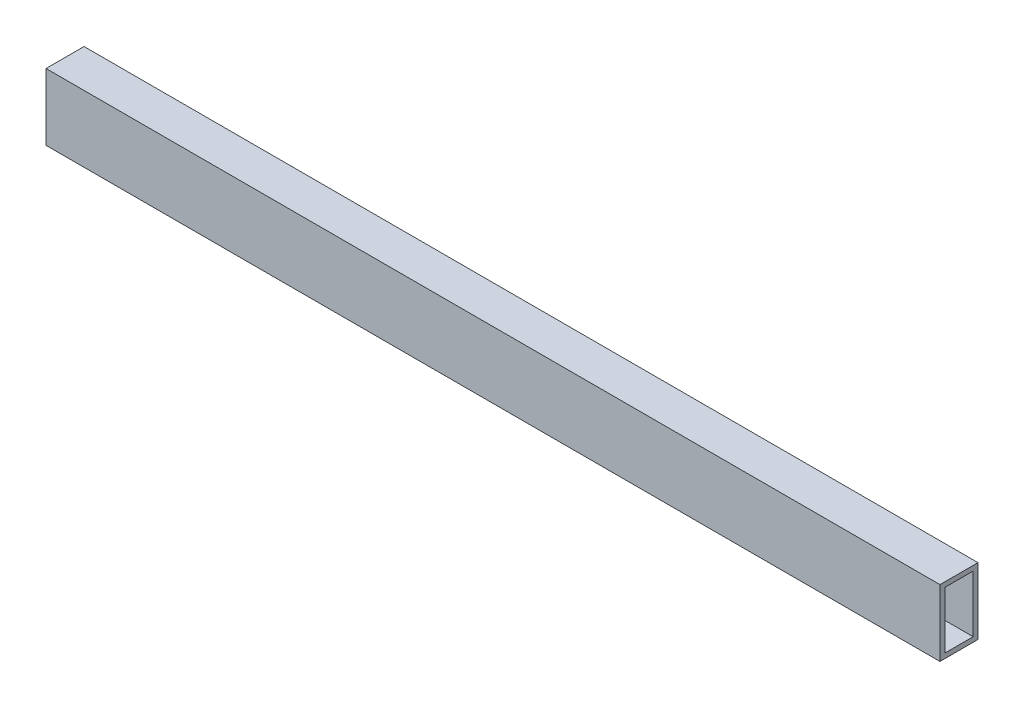
ISO-10303-21;
HEADER;
FILE_DESCRIPTION(('STEP AP214'),'2;1');
FILE_NAME('part.step','',(''),(''),'','','');
FILE_SCHEMA(('AUTOMOTIVE_DESIGN { 1 0 10303 214 1 1 1 1 }'));
ENDSEC;
DATA;
#1=APPLICATION_CONTEXT('core data for automotive mechanical design processes');
#2=APPLICATION_PROTOCOL_DEFINITION('international standard','automotive_design',2000,#1);
#3=PRODUCT_CONTEXT('',#1,'mechanical');
#4=PRODUCT('Part','Part','',(#3));
#5=PRODUCT_RELATED_PRODUCT_CATEGORY('part','',(#4));
#6=PRODUCT_DEFINITION_FORMATION('','',#4);
#7=PRODUCT_DEFINITION_CONTEXT('part definition',#1,'design');
#8=PRODUCT_DEFINITION('design','',#6,#7);
#9=PRODUCT_DEFINITION_SHAPE('','',#8);
#10=(LENGTH_UNIT() NAMED_UNIT(*) SI_UNIT(.MILLI.,.METRE.));
#11=(NAMED_UNIT(*) PLANE_ANGLE_UNIT() SI_UNIT($,.RADIAN.));
#12=(NAMED_UNIT(*) SI_UNIT($,.STERADIAN.) SOLID_ANGLE_UNIT());
#13=UNCERTAINTY_MEASURE_WITH_UNIT(LENGTH_MEASURE(1.E-05),#10,'distance_accuracy_value','');
#14=(GEOMETRIC_REPRESENTATION_CONTEXT(3) GLOBAL_UNCERTAINTY_ASSIGNED_CONTEXT((#13)) GLOBAL_UNIT_ASSIGNED_CONTEXT((#10,
#11,#12)) REPRESENTATION_CONTEXT('',''));
#15=CARTESIAN_POINT('',(0.,0.,0.));
#16=DIRECTION('',(0.,0.,1.));
#17=DIRECTION('',(1.,0.,0.));
#18=AXIS2_PLACEMENT_3D('',#15,#16,#17);
#19=CARTESIAN_POINT('',(-9470.21817788958,3159.13142400252,25.4));
#20=DIRECTION('',(1.,0.,0.));
#21=DIRECTION('',(0.,0.,-1.));
#22=AXIS2_PLACEMENT_3D('',#19,#20,#21);
#23=PLANE('',#22);
#24=DIRECTION('',(0.,0.,1.));
#25=VECTOR('',#24,1.);
#26=CARTESIAN_POINT('',(-9470.21817788958,3155.89292400252,25.4));
#27=LINE('',#26,#25);
#28=CARTESIAN_POINT('',(-9470.21817788958,3155.89292400252,3.2385));
#29=VERTEX_POINT('',#28);
#30=CARTESIAN_POINT('',(-9470.21817788958,3155.89292400252,22.1615));
#31=VERTEX_POINT('',#30);
#32=EDGE_CURVE('E144',#29,#31,#27,.T.);
#33=ORIENTED_EDGE('',*,*,#32,.T.);
#34=DIRECTION('',(0.,-1.,0.));
#35=VECTOR('',#34,1.);
#36=CARTESIAN_POINT('',(-9470.21817788958,3159.13142400252,22.1615));
#37=LINE('',#36,#35);
#38=CARTESIAN_POINT('',(-9470.21817788958,3117.91992400252,22.1615));
#39=VERTEX_POINT('',#38);
#40=EDGE_CURVE('E148',#31,#39,#37,.T.);
#41=ORIENTED_EDGE('',*,*,#40,.T.);
#42=DIRECTION('',(0.,0.,-1.));
#43=VECTOR('',#42,1.);
#44=CARTESIAN_POINT('',(-9470.21817788958,3117.91992400252,25.4));
#45=LINE('',#44,#43);
#46=CARTESIAN_POINT('',(-9470.21817788958,3117.91992400252,3.23849999999999));
#47=VERTEX_POINT('',#46);
#48=EDGE_CURVE('E135',#39,#47,#45,.T.);
#49=ORIENTED_EDGE('',*,*,#48,.T.);
#50=DIRECTION('',(0.,1.,0.));
#51=VECTOR('',#50,1.);
#52=CARTESIAN_POINT('',(-9470.21817788958,3159.13142400252,3.2385));
#53=LINE('',#52,#51);
#54=EDGE_CURVE('E110',#47,#29,#53,.T.);
#55=ORIENTED_EDGE('',*,*,#54,.T.);
#56=EDGE_LOOP('',(#33,#41,#49,#55));
#57=FACE_BOUND('',#56,.T.);
#58=DIRECTION('',(0.,-1.,0.));
#59=VECTOR('',#58,1.);
#60=CARTESIAN_POINT('',(-9470.21817788958,3159.13142400252,0.));
#61=LINE('',#60,#59);
#62=CARTESIAN_POINT('',(-9470.21817788958,3159.13142400252,0.));
#63=VERTEX_POINT('',#62);
#64=CARTESIAN_POINT('',(-9470.21817788958,3114.68142400252,0.));
#65=VERTEX_POINT('',#64);
#66=EDGE_CURVE('E152',#63,#65,#61,.T.);
#67=ORIENTED_EDGE('',*,*,#66,.T.);
#68=DIRECTION('',(0.,0.,-1.));
#69=VECTOR('',#68,1.);
#70=CARTESIAN_POINT('',(-9470.21817788958,3114.68142400252,25.4));
#71=LINE('',#70,#69);
#72=CARTESIAN_POINT('',(-9470.21817788958,3114.68142400252,25.4));
#73=VERTEX_POINT('',#72);
#74=EDGE_CURVE('E11',#73,#65,#71,.T.);
#75=ORIENTED_EDGE('',*,*,#74,.F.);
#76=DIRECTION('',(0.,-1.,0.));
#77=VECTOR('',#76,1.);
#78=CARTESIAN_POINT('',(-9470.21817788958,3159.13142400252,25.4));
#79=LINE('',#78,#77);
#80=CARTESIAN_POINT('',(-9470.21817788958,3159.13142400252,25.4));
#81=VERTEX_POINT('',#80);
#82=EDGE_CURVE('E153',#81,#73,#79,.T.);
#83=ORIENTED_EDGE('',*,*,#82,.F.);
#84=DIRECTION('',(0.,0.,-1.));
#85=VECTOR('',#84,1.);
#86=CARTESIAN_POINT('',(-9470.21817788958,3159.13142400252,25.4));
#87=LINE('',#86,#85);
#88=EDGE_CURVE('E167',#81,#63,#87,.T.);
#89=ORIENTED_EDGE('',*,*,#88,.T.);
#90=EDGE_LOOP('',(#67,#75,#83,#89));
#91=FACE_BOUND('',#90,.T.);
#92=ADVANCED_FACE('F39',(#57,#91),#23,.F.);
#93=CARTESIAN_POINT('',(-9470.21817788958,3114.68142400252,25.4));
#94=DIRECTION('',(0.,1.,0.));
#95=DIRECTION('',(0.,0.,1.));
#96=AXIS2_PLACEMENT_3D('',#93,#94,#95);
#97=PLANE('',#96);
#98=DIRECTION('',(1.,0.,0.));
#99=VECTOR('',#98,1.);
#100=CARTESIAN_POINT('',(-9470.21817788958,3114.68142400252,0.));
#101=LINE('',#100,#99);
#102=CARTESIAN_POINT('',(-8873.31817788958,3114.68142400252,0.));
#103=VERTEX_POINT('',#102);
#104=EDGE_CURVE('E171',#65,#103,#101,.T.);
#105=ORIENTED_EDGE('',*,*,#104,.T.);
#106=DIRECTION('',(0.,0.,-1.));
#107=VECTOR('',#106,1.);
#108=CARTESIAN_POINT('',(-8873.31817788958,3114.68142400252,25.4));
#109=LINE('',#108,#107);
#110=CARTESIAN_POINT('',(-8873.31817788958,3114.68142400252,25.4));
#111=VERTEX_POINT('',#110);
#112=EDGE_CURVE('E47',#111,#103,#109,.T.);
#113=ORIENTED_EDGE('',*,*,#112,.F.);
#114=DIRECTION('',(1.,0.,0.));
#115=VECTOR('',#114,1.);
#116=CARTESIAN_POINT('',(-9470.21817788958,3114.68142400252,25.4));
#117=LINE('',#116,#115);
#118=EDGE_CURVE('E157',#73,#111,#117,.T.);
#119=ORIENTED_EDGE('',*,*,#118,.F.);
#120=ORIENTED_EDGE('',*,*,#74,.T.);
#121=EDGE_LOOP('',(#105,#113,#119,#120));
#122=FACE_BOUND('',#121,.T.);
#123=ADVANCED_FACE('F205',(#122),#97,.F.);
#124=CARTESIAN_POINT('',(-8873.31817788958,3159.13142400252,25.4));
#125=DIRECTION('',(-1.,0.,0.));
#126=DIRECTION('',(0.,0.,1.));
#127=AXIS2_PLACEMENT_3D('',#124,#125,#126);
#128=PLANE('',#127);
#129=DIRECTION('',(0.,0.,-1.));
#130=VECTOR('',#129,1.);
#131=CARTESIAN_POINT('',(-8873.31817788958,3117.91992400252,22.1615));
#132=LINE('',#131,#130);
#133=CARTESIAN_POINT('',(-8873.31817788958,3117.91992400252,22.1615));
#134=VERTEX_POINT('',#133);
#135=CARTESIAN_POINT('',(-8873.31817788958,3117.91992400252,3.23849999999999));
#136=VERTEX_POINT('',#135);
#137=EDGE_CURVE('E117',#134,#136,#132,.T.);
#138=ORIENTED_EDGE('',*,*,#137,.F.);
#139=DIRECTION('',(0.,-1.,0.));
#140=VECTOR('',#139,1.);
#141=CARTESIAN_POINT('',(-8873.31817788958,3155.89292400252,22.1615));
#142=LINE('',#141,#140);
#143=CARTESIAN_POINT('',(-8873.31817788958,3155.89292400252,22.1615));
#144=VERTEX_POINT('',#143);
#145=EDGE_CURVE('E62',#144,#134,#142,.T.);
#146=ORIENTED_EDGE('',*,*,#145,.F.);
#147=DIRECTION('',(0.,0.,1.));
#148=VECTOR('',#147,1.);
#149=CARTESIAN_POINT('',(-8873.31817788958,3155.89292400252,22.1615));
#150=LINE('',#149,#148);
#151=CARTESIAN_POINT('',(-8873.31817788958,3155.89292400252,3.2385));
#152=VERTEX_POINT('',#151);
#153=EDGE_CURVE('E125',#152,#144,#150,.T.);
#154=ORIENTED_EDGE('',*,*,#153,.F.);
#155=DIRECTION('',(0.,1.,0.));
#156=VECTOR('',#155,1.);
#157=CARTESIAN_POINT('',(-8873.31817788958,3155.89292400252,3.2385));
#158=LINE('',#157,#156);
#159=EDGE_CURVE('E107',#136,#152,#158,.T.);
#160=ORIENTED_EDGE('',*,*,#159,.F.);
#161=EDGE_LOOP('',(#138,#146,#154,#160));
#162=FACE_BOUND('',#161,.T.);
#163=DIRECTION('',(0.,1.,0.));
#164=VECTOR('',#163,1.);
#165=CARTESIAN_POINT('',(-8873.31817788958,3159.13142400252,0.));
#166=LINE('',#165,#164);
#167=CARTESIAN_POINT('',(-8873.31817788958,3159.13142400252,0.));
#168=VERTEX_POINT('',#167);
#169=EDGE_CURVE('E174',#103,#168,#166,.T.);
#170=ORIENTED_EDGE('',*,*,#169,.T.);
#171=DIRECTION('',(0.,0.,-1.));
#172=VECTOR('',#171,1.);
#173=CARTESIAN_POINT('',(-8873.31817788958,3159.13142400252,25.4));
#174=LINE('',#173,#172);
#175=CARTESIAN_POINT('',(-8873.31817788958,3159.13142400252,25.4));
#176=VERTEX_POINT('',#175);
#177=EDGE_CURVE('E182',#176,#168,#174,.T.);
#178=ORIENTED_EDGE('',*,*,#177,.F.);
#179=DIRECTION('',(0.,1.,0.));
#180=VECTOR('',#179,1.);
#181=CARTESIAN_POINT('',(-8873.31817788958,3159.13142400252,25.4));
#182=LINE('',#181,#180);
#183=EDGE_CURVE('E161',#111,#176,#182,.T.);
#184=ORIENTED_EDGE('',*,*,#183,.F.);
#185=ORIENTED_EDGE('',*,*,#112,.T.);
#186=EDGE_LOOP('',(#170,#178,#184,#185));
#187=FACE_BOUND('',#186,.T.);
#188=ADVANCED_FACE('F122',(#162,#187),#128,.F.);
#189=CARTESIAN_POINT('',(-9470.21817788958,3159.13142400252,25.4));
#190=DIRECTION('',(0.,-1.,0.));
#191=DIRECTION('',(0.,0.,-1.));
#192=AXIS2_PLACEMENT_3D('',#189,#190,#191);
#193=PLANE('',#192);
#194=DIRECTION('',(-1.,0.,0.));
#195=VECTOR('',#194,1.);
#196=CARTESIAN_POINT('',(-9470.21817788958,3159.13142400252,0.));
#197=LINE('',#196,#195);
#198=EDGE_CURVE('E158',#168,#63,#197,.T.);
#199=ORIENTED_EDGE('',*,*,#198,.T.);
#200=ORIENTED_EDGE('',*,*,#88,.F.);
#201=DIRECTION('',(-1.,0.,0.));
#202=VECTOR('',#201,1.);
#203=CARTESIAN_POINT('',(-9470.21817788958,3159.13142400252,25.4));
#204=LINE('',#203,#202);
#205=EDGE_CURVE('E164',#176,#81,#204,.T.);
#206=ORIENTED_EDGE('',*,*,#205,.F.);
#207=ORIENTED_EDGE('',*,*,#177,.T.);
#208=EDGE_LOOP('',(#199,#200,#206,#207));
#209=FACE_BOUND('',#208,.T.);
#210=ADVANCED_FACE('F198',(#209),#193,.F.);
#211=CARTESIAN_POINT('',(0.,0.,25.4));
#212=DIRECTION('',(0.,0.,1.));
#213=DIRECTION('',(1.,0.,0.));
#214=AXIS2_PLACEMENT_3D('',#211,#212,#213);
#215=PLANE('',#214);
#216=ORIENTED_EDGE('',*,*,#82,.T.);
#217=ORIENTED_EDGE('',*,*,#118,.T.);
#218=ORIENTED_EDGE('',*,*,#183,.T.);
#219=ORIENTED_EDGE('',*,*,#205,.T.);
#220=EDGE_LOOP('',(#216,#217,#218,#219));
#221=FACE_BOUND('',#220,.T.);
#222=ADVANCED_FACE('F204',(#221),#215,.T.);
#223=CARTESIAN_POINT('',(0.,0.,0.));
#224=DIRECTION('',(0.,0.,1.));
#225=DIRECTION('',(1.,0.,0.));
#226=AXIS2_PLACEMENT_3D('',#223,#224,#225);
#227=PLANE('',#226);
#228=ORIENTED_EDGE('',*,*,#66,.F.);
#229=ORIENTED_EDGE('',*,*,#198,.F.);
#230=ORIENTED_EDGE('',*,*,#169,.F.);
#231=ORIENTED_EDGE('',*,*,#104,.F.);
#232=EDGE_LOOP('',(#228,#229,#230,#231));
#233=FACE_BOUND('',#232,.T.);
#234=ADVANCED_FACE('F195',(#233),#227,.F.);
#235=CARTESIAN_POINT('',(-9472.75817788958,3155.89292400252,22.1615));
#236=DIRECTION('',(0.,0.,1.));
#237=DIRECTION('',(0.,-1.,0.));
#238=AXIS2_PLACEMENT_3D('',#235,#236,#237);
#239=PLANE('',#238);
#240=DIRECTION('',(1.,0.,0.));
#241=VECTOR('',#240,1.);
#242=CARTESIAN_POINT('',(-9472.75817788958,3155.89292400252,22.1615));
#243=LINE('',#242,#241);
#244=EDGE_CURVE('E132',#31,#144,#243,.T.);
#245=ORIENTED_EDGE('',*,*,#244,.T.);
#246=ORIENTED_EDGE('',*,*,#145,.T.);
#247=DIRECTION('',(1.,0.,0.));
#248=VECTOR('',#247,1.);
#249=CARTESIAN_POINT('',(-9472.75817788958,3117.91992400252,22.1615));
#250=LINE('',#249,#248);
#251=EDGE_CURVE('E114',#39,#134,#250,.T.);
#252=ORIENTED_EDGE('',*,*,#251,.F.);
#253=ORIENTED_EDGE('',*,*,#40,.F.);
#254=EDGE_LOOP('',(#245,#246,#252,#253));
#255=FACE_BOUND('',#254,.T.);
#256=ADVANCED_FACE('F218',(#255),#239,.F.);
#257=CARTESIAN_POINT('',(-9472.75817788958,3155.89292400252,22.1615));
#258=DIRECTION('',(0.,1.,0.));
#259=DIRECTION('',(0.,0.,1.));
#260=AXIS2_PLACEMENT_3D('',#257,#258,#259);
#261=PLANE('',#260);
#262=DIRECTION('',(1.,0.,0.));
#263=VECTOR('',#262,1.);
#264=CARTESIAN_POINT('',(-9472.75817788958,3155.89292400252,3.2385));
#265=LINE('',#264,#263);
#266=EDGE_CURVE('E113',#29,#152,#265,.T.);
#267=ORIENTED_EDGE('',*,*,#266,.T.);
#268=ORIENTED_EDGE('',*,*,#153,.T.);
#269=ORIENTED_EDGE('',*,*,#244,.F.);
#270=ORIENTED_EDGE('',*,*,#32,.F.);
#271=EDGE_LOOP('',(#267,#268,#269,#270));
#272=FACE_BOUND('',#271,.T.);
#273=ADVANCED_FACE('F223',(#272),#261,.F.);
#274=CARTESIAN_POINT('',(-9472.75817788958,3155.89292400252,3.2385));
#275=DIRECTION('',(0.,0.,-1.));
#276=DIRECTION('',(0.,1.,0.));
#277=AXIS2_PLACEMENT_3D('',#274,#275,#276);
#278=PLANE('',#277);
#279=DIRECTION('',(1.,0.,0.));
#280=VECTOR('',#279,1.);
#281=CARTESIAN_POINT('',(-9472.75817788958,3117.91992400252,3.23849999999999));
#282=LINE('',#281,#280);
#283=EDGE_CURVE('E54',#47,#136,#282,.T.);
#284=ORIENTED_EDGE('',*,*,#283,.T.);
#285=ORIENTED_EDGE('',*,*,#159,.T.);
#286=ORIENTED_EDGE('',*,*,#266,.F.);
#287=ORIENTED_EDGE('',*,*,#54,.F.);
#288=EDGE_LOOP('',(#284,#285,#286,#287));
#289=FACE_BOUND('',#288,.T.);
#290=ADVANCED_FACE('F104',(#289),#278,.F.);
#291=CARTESIAN_POINT('',(-9472.75817788958,3117.91992400252,22.1615));
#292=DIRECTION('',(0.,-1.,0.));
#293=DIRECTION('',(0.,0.,-1.));
#294=AXIS2_PLACEMENT_3D('',#291,#292,#293);
#295=PLANE('',#294);
#296=ORIENTED_EDGE('',*,*,#251,.T.);
#297=ORIENTED_EDGE('',*,*,#137,.T.);
#298=ORIENTED_EDGE('',*,*,#283,.F.);
#299=ORIENTED_EDGE('',*,*,#48,.F.);
#300=EDGE_LOOP('',(#296,#297,#298,#299));
#301=FACE_BOUND('',#300,.T.);
#302=ADVANCED_FACE('F118',(#301),#295,.F.);
#303=CLOSED_SHELL('',(#92,#123,#188,#210,#222,#234,#256,#273,#290,#302));
#304=MANIFOLD_SOLID_BREP('B2',#303);
#305=ADVANCED_BREP_SHAPE_REPRESENTATION('',(#18,#304),#14);
#306=SHAPE_DEFINITION_REPRESENTATION(#9,#305);
ENDSEC;
END-ISO-10303-21;
